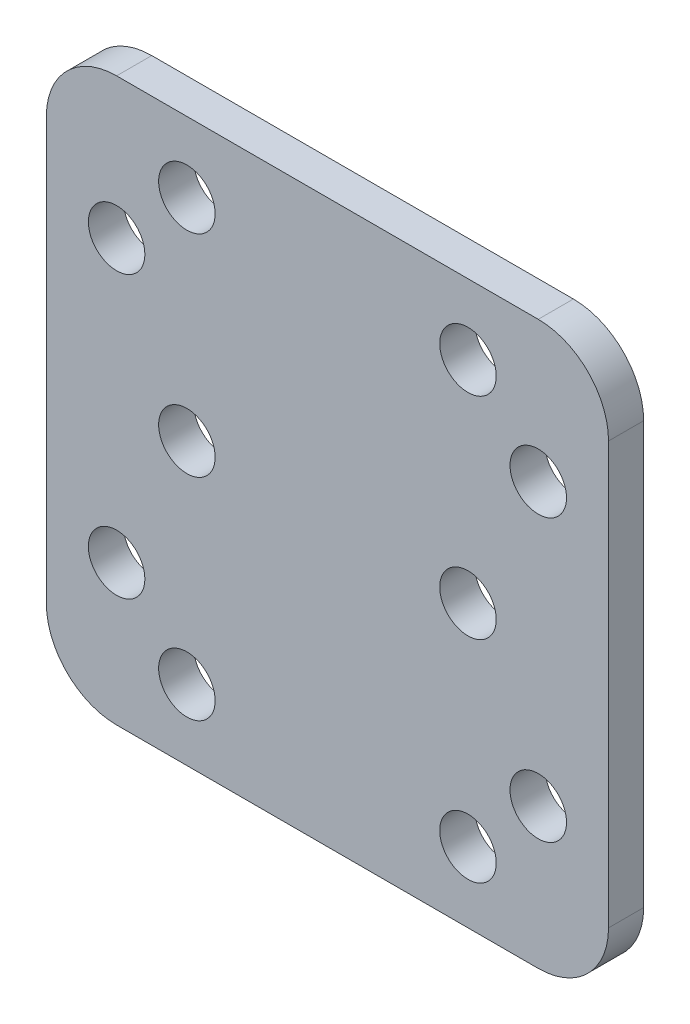
ISO-10303-21;
HEADER;
FILE_DESCRIPTION(('STEP AP214'),'2;1');
FILE_NAME('part.step','',(''),(''),'','','');
FILE_SCHEMA(('AUTOMOTIVE_DESIGN { 1 0 10303 214 1 1 1 1 }'));
ENDSEC;
DATA;
#1=APPLICATION_CONTEXT('core data for automotive mechanical design processes');
#2=APPLICATION_PROTOCOL_DEFINITION('international standard','automotive_design',2000,#1);
#3=PRODUCT_CONTEXT('',#1,'mechanical');
#4=PRODUCT('Part','Part','',(#3));
#5=PRODUCT_RELATED_PRODUCT_CATEGORY('part','',(#4));
#6=PRODUCT_DEFINITION_FORMATION('','',#4);
#7=PRODUCT_DEFINITION_CONTEXT('part definition',#1,'design');
#8=PRODUCT_DEFINITION('design','',#6,#7);
#9=PRODUCT_DEFINITION_SHAPE('','',#8);
#10=(LENGTH_UNIT() NAMED_UNIT(*) SI_UNIT(.MILLI.,.METRE.));
#11=(NAMED_UNIT(*) PLANE_ANGLE_UNIT() SI_UNIT($,.RADIAN.));
#12=(NAMED_UNIT(*) SI_UNIT($,.STERADIAN.) SOLID_ANGLE_UNIT());
#13=UNCERTAINTY_MEASURE_WITH_UNIT(LENGTH_MEASURE(1.E-05),#10,'distance_accuracy_value','');
#14=(GEOMETRIC_REPRESENTATION_CONTEXT(3) GLOBAL_UNCERTAINTY_ASSIGNED_CONTEXT((#13)) GLOBAL_UNIT_ASSIGNED_CONTEXT((#10,
#11,#12)) REPRESENTATION_CONTEXT('',''));
#15=CARTESIAN_POINT('',(0.,0.,0.));
#16=DIRECTION('',(0.,0.,1.));
#17=DIRECTION('',(1.,0.,0.));
#18=AXIS2_PLACEMENT_3D('',#15,#16,#17);
#19=CARTESIAN_POINT('',(6.34999999985809,2.37276864822889E-11,0.));
#20=DIRECTION('',(0.,0.,1.));
#21=DIRECTION('',(1.,0.,0.));
#22=AXIS2_PLACEMENT_3D('',#19,#20,#21);
#23=PLANE('',#22);
#24=CARTESIAN_POINT('',(-12.7000000001419,12.7000000000238,0.));
#25=DIRECTION('',(0.,0.,-1.));
#26=DIRECTION('',(-1.,0.,0.));
#27=AXIS2_PLACEMENT_3D('',#24,#25,#26);
#28=CIRCLE('',#27,2.5527);
#29=CARTESIAN_POINT('',(-10.1473000001419,12.7000000000238,0.));
#30=VERTEX_POINT('',#29);
#31=EDGE_CURVE('E186',#30,#30,#28,.T.);
#32=ORIENTED_EDGE('',*,*,#31,.F.);
#33=EDGE_LOOP('',(#32));
#34=FACE_BOUND('',#33,.T.);
#35=CARTESIAN_POINT('',(-6.35000000014201,19.0500000000238,0.));
#36=DIRECTION('',(0.,0.,-1.));
#37=DIRECTION('',(-1.,0.,0.));
#38=AXIS2_PLACEMENT_3D('',#35,#36,#37);
#39=CIRCLE('',#38,2.5527);
#40=CARTESIAN_POINT('',(-3.79730000014201,19.0500000000238,0.));
#41=VERTEX_POINT('',#40);
#42=EDGE_CURVE('E206',#41,#41,#39,.T.);
#43=ORIENTED_EDGE('',*,*,#42,.F.);
#44=EDGE_LOOP('',(#43));
#45=FACE_BOUND('',#44,.T.);
#46=CARTESIAN_POINT('',(19.0499999998582,19.0500000000238,0.));
#47=DIRECTION('',(0.,0.,-1.));
#48=DIRECTION('',(-1.,0.,0.));
#49=AXIS2_PLACEMENT_3D('',#46,#47,#48);
#50=CIRCLE('',#49,2.5527);
#51=CARTESIAN_POINT('',(21.6026999998582,19.0500000000238,0.));
#52=VERTEX_POINT('',#51);
#53=EDGE_CURVE('E224',#52,#52,#50,.T.);
#54=ORIENTED_EDGE('',*,*,#53,.F.);
#55=EDGE_LOOP('',(#54));
#56=FACE_BOUND('',#55,.T.);
#57=CARTESIAN_POINT('',(19.0499999998582,2.35908870584317E-11,0.));
#58=DIRECTION('',(0.,0.,-1.));
#59=DIRECTION('',(-1.,0.,0.));
#60=AXIS2_PLACEMENT_3D('',#57,#58,#59);
#61=CIRCLE('',#60,2.5527);
#62=CARTESIAN_POINT('',(21.6026999998582,2.35901822884954E-11,0.));
#63=VERTEX_POINT('',#62);
#64=EDGE_CURVE('E205',#63,#63,#61,.T.);
#65=ORIENTED_EDGE('',*,*,#64,.F.);
#66=EDGE_LOOP('',(#65));
#67=FACE_BOUND('',#66,.T.);
#68=CARTESIAN_POINT('',(25.3999999998581,12.7000000000238,0.));
#69=DIRECTION('',(0.,0.,-1.));
#70=DIRECTION('',(-1.,0.,0.));
#71=AXIS2_PLACEMENT_3D('',#68,#69,#70);
#72=CIRCLE('',#71,2.5527);
#73=CARTESIAN_POINT('',(27.952699999858,12.7000000000238,0.));
#74=VERTEX_POINT('',#73);
#75=EDGE_CURVE('E281',#74,#74,#72,.T.);
#76=ORIENTED_EDGE('',*,*,#75,.F.);
#77=EDGE_LOOP('',(#76));
#78=FACE_BOUND('',#77,.T.);
#79=CARTESIAN_POINT('',(25.3999999998581,-12.6999999999764,0.));
#80=DIRECTION('',(0.,0.,-1.));
#81=DIRECTION('',(-1.,0.,0.));
#82=AXIS2_PLACEMENT_3D('',#79,#80,#81);
#83=CIRCLE('',#82,2.5527);
#84=CARTESIAN_POINT('',(27.952699999858,-12.6999999999764,0.));
#85=VERTEX_POINT('',#84);
#86=EDGE_CURVE('E259',#85,#85,#83,.T.);
#87=ORIENTED_EDGE('',*,*,#86,.F.);
#88=EDGE_LOOP('',(#87));
#89=FACE_BOUND('',#88,.T.);
#90=CARTESIAN_POINT('',(19.0499999998582,-19.0499999999764,0.));
#91=DIRECTION('',(0.,0.,-1.));
#92=DIRECTION('',(-1.,0.,0.));
#93=AXIS2_PLACEMENT_3D('',#90,#91,#92);
#94=CIRCLE('',#93,2.5527);
#95=CARTESIAN_POINT('',(21.6026999998582,-19.0499999999764,0.));
#96=VERTEX_POINT('',#95);
#97=EDGE_CURVE('E299',#96,#96,#94,.T.);
#98=ORIENTED_EDGE('',*,*,#97,.F.);
#99=EDGE_LOOP('',(#98));
#100=FACE_BOUND('',#99,.T.);
#101=CARTESIAN_POINT('',(-6.35000000014201,-19.0499999999764,0.));
#102=DIRECTION('',(0.,0.,-1.));
#103=DIRECTION('',(-1.,0.,0.));
#104=AXIS2_PLACEMENT_3D('',#101,#102,#103);
#105=CIRCLE('',#104,2.5527);
#106=CARTESIAN_POINT('',(-3.79730000014201,-19.0499999999764,0.));
#107=VERTEX_POINT('',#106);
#108=EDGE_CURVE('E310',#107,#107,#105,.T.);
#109=ORIENTED_EDGE('',*,*,#108,.F.);
#110=EDGE_LOOP('',(#109));
#111=FACE_BOUND('',#110,.T.);
#112=CARTESIAN_POINT('',(-12.7000000001419,-12.6999999999764,0.));
#113=DIRECTION('',(0.,0.,-1.));
#114=DIRECTION('',(-1.,0.,0.));
#115=AXIS2_PLACEMENT_3D('',#112,#113,#114);
#116=CIRCLE('',#115,2.5527);
#117=CARTESIAN_POINT('',(-10.1473000001419,-12.6999999999764,0.));
#118=VERTEX_POINT('',#117);
#119=EDGE_CURVE('E321',#118,#118,#116,.T.);
#120=ORIENTED_EDGE('',*,*,#119,.F.);
#121=EDGE_LOOP('',(#120));
#122=FACE_BOUND('',#121,.T.);
#123=CARTESIAN_POINT('',(-6.35000000014201,2.35832467290903E-11,0.));
#124=DIRECTION('',(0.,0.,-1.));
#125=DIRECTION('',(-1.,0.,0.));
#126=AXIS2_PLACEMENT_3D('',#123,#124,#125);
#127=CIRCLE('',#126,2.5527);
#128=CARTESIAN_POINT('',(-3.79730000014201,2.35825419591539E-11,0.));
#129=VERTEX_POINT('',#128);
#130=EDGE_CURVE('E241',#129,#129,#127,.T.);
#131=ORIENTED_EDGE('',*,*,#130,.F.);
#132=EDGE_LOOP('',(#131));
#133=FACE_BOUND('',#132,.T.);
#134=DIRECTION('',(1.,0.,0.));
#135=VECTOR('',#134,1.);
#136=CARTESIAN_POINT('',(-12.700000000142,-25.3999999999765,0.));
#137=LINE('',#136,#135);
#138=CARTESIAN_POINT('',(-12.700000000142,-25.3999999999765,0.));
#139=VERTEX_POINT('',#138);
#140=CARTESIAN_POINT('',(25.3999999998581,-25.3999999999764,0.));
#141=VERTEX_POINT('',#140);
#142=EDGE_CURVE('E25',#139,#141,#137,.T.);
#143=ORIENTED_EDGE('',*,*,#142,.F.);
#144=CARTESIAN_POINT('',(-12.7000000001419,-19.0499999999764,0.));
#145=DIRECTION('',(0.,0.,1.));
#146=DIRECTION('',(-1.,0.,0.));
#147=AXIS2_PLACEMENT_3D('',#144,#145,#146);
#148=CIRCLE('',#147,6.35);
#149=CARTESIAN_POINT('',(-19.0500000001419,-19.0499999999763,0.));
#150=VERTEX_POINT('',#149);
#151=EDGE_CURVE('E237',#150,#139,#148,.T.);
#152=ORIENTED_EDGE('',*,*,#151,.F.);
#153=DIRECTION('',(0.,-1.,0.));
#154=VECTOR('',#153,1.);
#155=CARTESIAN_POINT('',(-19.0500000001419,19.0500000000237,0.));
#156=LINE('',#155,#154);
#157=CARTESIAN_POINT('',(-19.0500000001419,19.0500000000237,0.));
#158=VERTEX_POINT('',#157);
#159=EDGE_CURVE('E258',#158,#150,#156,.T.);
#160=ORIENTED_EDGE('',*,*,#159,.F.);
#161=CARTESIAN_POINT('',(-12.7000000001419,19.0500000000238,0.));
#162=DIRECTION('',(0.,0.,1.));
#163=DIRECTION('',(0.,1.,0.));
#164=AXIS2_PLACEMENT_3D('',#161,#162,#163);
#165=CIRCLE('',#164,6.35);
#166=CARTESIAN_POINT('',(-12.700000000142,25.4000000000238,0.));
#167=VERTEX_POINT('',#166);
#168=EDGE_CURVE('E275',#167,#158,#165,.T.);
#169=ORIENTED_EDGE('',*,*,#168,.F.);
#170=DIRECTION('',(-1.,0.,0.));
#171=VECTOR('',#170,1.);
#172=CARTESIAN_POINT('',(25.3999999998582,25.4000000000238,0.));
#173=LINE('',#172,#171);
#174=CARTESIAN_POINT('',(25.3999999998582,25.4000000000238,0.));
#175=VERTEX_POINT('',#174);
#176=EDGE_CURVE('E267',#175,#167,#173,.T.);
#177=ORIENTED_EDGE('',*,*,#176,.F.);
#178=CARTESIAN_POINT('',(25.3999999998581,19.0500000000238,0.));
#179=DIRECTION('',(0.,0.,1.));
#180=DIRECTION('',(1.,0.,0.));
#181=AXIS2_PLACEMENT_3D('',#178,#179,#180);
#182=CIRCLE('',#181,6.35);
#183=CARTESIAN_POINT('',(31.749999999858,19.0500000000238,0.));
#184=VERTEX_POINT('',#183);
#185=EDGE_CURVE('E214',#184,#175,#182,.T.);
#186=ORIENTED_EDGE('',*,*,#185,.F.);
#187=DIRECTION('',(0.,1.,0.));
#188=VECTOR('',#187,1.);
#189=CARTESIAN_POINT('',(31.749999999858,-19.0499999999764,0.));
#190=LINE('',#189,#188);
#191=CARTESIAN_POINT('',(31.749999999858,-19.0499999999764,0.));
#192=VERTEX_POINT('',#191);
#193=EDGE_CURVE('E361',#192,#184,#190,.T.);
#194=ORIENTED_EDGE('',*,*,#193,.F.);
#195=CARTESIAN_POINT('',(25.3999999998581,-19.0499999999764,0.));
#196=DIRECTION('',(0.,0.,1.));
#197=DIRECTION('',(0.,-1.,0.));
#198=AXIS2_PLACEMENT_3D('',#195,#196,#197);
#199=CIRCLE('',#198,6.35);
#200=EDGE_CURVE('E305',#141,#192,#199,.T.);
#201=ORIENTED_EDGE('',*,*,#200,.F.);
#202=EDGE_LOOP('',(#143,#152,#160,#169,#177,#186,#194,#201));
#203=FACE_BOUND('',#202,.T.);
#204=ADVANCED_FACE('F17',(#34,#45,#56,#67,#78,#89,#100,#111,#122,#133,#203),#23,.F.);
#205=CARTESIAN_POINT('',(6.34999999985809,2.37276864822889E-11,3.175));
#206=DIRECTION('',(0.,0.,1.));
#207=DIRECTION('',(1.,0.,0.));
#208=AXIS2_PLACEMENT_3D('',#205,#206,#207);
#209=PLANE('',#208);
#210=CARTESIAN_POINT('',(-12.7000000001419,12.7000000000238,3.175));
#211=DIRECTION('',(0.,0.,-1.));
#212=DIRECTION('',(-1.,0.,0.));
#213=AXIS2_PLACEMENT_3D('',#210,#211,#212);
#214=CIRCLE('',#213,2.5527);
#215=CARTESIAN_POINT('',(-10.1473000001419,12.7000000000238,3.175));
#216=VERTEX_POINT('',#215);
#217=EDGE_CURVE('E184',#216,#216,#214,.T.);
#218=ORIENTED_EDGE('',*,*,#217,.T.);
#219=EDGE_LOOP('',(#218));
#220=FACE_BOUND('',#219,.T.);
#221=CARTESIAN_POINT('',(-6.35000000014201,19.0500000000238,3.175));
#222=DIRECTION('',(0.,0.,-1.));
#223=DIRECTION('',(-1.,0.,0.));
#224=AXIS2_PLACEMENT_3D('',#221,#222,#223);
#225=CIRCLE('',#224,2.5527);
#226=CARTESIAN_POINT('',(-3.79730000014201,19.0500000000238,3.175));
#227=VERTEX_POINT('',#226);
#228=EDGE_CURVE('E213',#227,#227,#225,.T.);
#229=ORIENTED_EDGE('',*,*,#228,.T.);
#230=EDGE_LOOP('',(#229));
#231=FACE_BOUND('',#230,.T.);
#232=CARTESIAN_POINT('',(19.0499999998582,19.0500000000238,3.175));
#233=DIRECTION('',(0.,0.,-1.));
#234=DIRECTION('',(-1.,0.,0.));
#235=AXIS2_PLACEMENT_3D('',#232,#233,#234);
#236=CIRCLE('',#235,2.5527);
#237=CARTESIAN_POINT('',(21.6026999998582,19.0500000000238,3.175));
#238=VERTEX_POINT('',#237);
#239=EDGE_CURVE('E209',#238,#238,#236,.T.);
#240=ORIENTED_EDGE('',*,*,#239,.T.);
#241=EDGE_LOOP('',(#240));
#242=FACE_BOUND('',#241,.T.);
#243=CARTESIAN_POINT('',(19.0499999998582,2.35908870584317E-11,3.175));
#244=DIRECTION('',(0.,0.,-1.));
#245=DIRECTION('',(-1.,0.,0.));
#246=AXIS2_PLACEMENT_3D('',#243,#244,#245);
#247=CIRCLE('',#246,2.5527);
#248=CARTESIAN_POINT('',(21.6026999998582,2.35900188272353E-11,3.175));
#249=VERTEX_POINT('',#248);
#250=EDGE_CURVE('E219',#249,#249,#247,.T.);
#251=ORIENTED_EDGE('',*,*,#250,.T.);
#252=EDGE_LOOP('',(#251));
#253=FACE_BOUND('',#252,.T.);
#254=CARTESIAN_POINT('',(25.3999999998581,12.7000000000238,3.175));
#255=DIRECTION('',(0.,0.,-1.));
#256=DIRECTION('',(-1.,0.,0.));
#257=AXIS2_PLACEMENT_3D('',#254,#255,#256);
#258=CIRCLE('',#257,2.5527);
#259=CARTESIAN_POINT('',(27.952699999858,12.7000000000238,3.175));
#260=VERTEX_POINT('',#259);
#261=EDGE_CURVE('E200',#260,#260,#258,.T.);
#262=ORIENTED_EDGE('',*,*,#261,.T.);
#263=EDGE_LOOP('',(#262));
#264=FACE_BOUND('',#263,.T.);
#265=CARTESIAN_POINT('',(25.3999999998581,-12.6999999999764,3.175));
#266=DIRECTION('',(0.,0.,-1.));
#267=DIRECTION('',(-1.,0.,0.));
#268=AXIS2_PLACEMENT_3D('',#265,#266,#267);
#269=CIRCLE('',#268,2.5527);
#270=CARTESIAN_POINT('',(27.952699999858,-12.6999999999764,3.175));
#271=VERTEX_POINT('',#270);
#272=EDGE_CURVE('E197',#271,#271,#269,.T.);
#273=ORIENTED_EDGE('',*,*,#272,.T.);
#274=EDGE_LOOP('',(#273));
#275=FACE_BOUND('',#274,.T.);
#276=CARTESIAN_POINT('',(19.0499999998582,-19.0499999999764,3.175));
#277=DIRECTION('',(0.,0.,-1.));
#278=DIRECTION('',(-1.,0.,0.));
#279=AXIS2_PLACEMENT_3D('',#276,#277,#278);
#280=CIRCLE('',#279,2.5527);
#281=CARTESIAN_POINT('',(21.6026999998582,-19.0499999999764,3.175));
#282=VERTEX_POINT('',#281);
#283=EDGE_CURVE('E262',#282,#282,#280,.T.);
#284=ORIENTED_EDGE('',*,*,#283,.T.);
#285=EDGE_LOOP('',(#284));
#286=FACE_BOUND('',#285,.T.);
#287=CARTESIAN_POINT('',(-6.35000000014201,-19.0499999999764,3.175));
#288=DIRECTION('',(0.,0.,-1.));
#289=DIRECTION('',(-1.,0.,0.));
#290=AXIS2_PLACEMENT_3D('',#287,#288,#289);
#291=CIRCLE('',#290,2.5527);
#292=CARTESIAN_POINT('',(-3.79730000014201,-19.0499999999764,3.175));
#293=VERTEX_POINT('',#292);
#294=EDGE_CURVE('E302',#293,#293,#291,.T.);
#295=ORIENTED_EDGE('',*,*,#294,.T.);
#296=EDGE_LOOP('',(#295));
#297=FACE_BOUND('',#296,.T.);
#298=CARTESIAN_POINT('',(-12.7000000001419,-12.6999999999764,3.175));
#299=DIRECTION('',(0.,0.,-1.));
#300=DIRECTION('',(-1.,0.,0.));
#301=AXIS2_PLACEMENT_3D('',#298,#299,#300);
#302=CIRCLE('',#301,2.5527);
#303=CARTESIAN_POINT('',(-10.1473000001419,-12.6999999999764,3.175));
#304=VERTEX_POINT('',#303);
#305=EDGE_CURVE('E313',#304,#304,#302,.T.);
#306=ORIENTED_EDGE('',*,*,#305,.T.);
#307=EDGE_LOOP('',(#306));
#308=FACE_BOUND('',#307,.T.);
#309=CARTESIAN_POINT('',(-6.35000000014201,2.35832467290903E-11,3.175));
#310=DIRECTION('',(0.,0.,-1.));
#311=DIRECTION('',(-1.,0.,0.));
#312=AXIS2_PLACEMENT_3D('',#309,#310,#311);
#313=CIRCLE('',#312,2.5527);
#314=CARTESIAN_POINT('',(-3.79730000014201,2.35811370430383E-11,3.175));
#315=VERTEX_POINT('',#314);
#316=EDGE_CURVE('E295',#315,#315,#313,.T.);
#317=ORIENTED_EDGE('',*,*,#316,.T.);
#318=EDGE_LOOP('',(#317));
#319=FACE_BOUND('',#318,.T.);
#320=DIRECTION('',(1.,0.,0.));
#321=VECTOR('',#320,1.);
#322=CARTESIAN_POINT('',(-12.700000000142,-25.3999999999765,3.175));
#323=LINE('',#322,#321);
#324=CARTESIAN_POINT('',(-12.700000000142,-25.3999999999765,3.175));
#325=VERTEX_POINT('',#324);
#326=CARTESIAN_POINT('',(25.3999999998581,-25.3999999999764,3.175));
#327=VERTEX_POINT('',#326);
#328=EDGE_CURVE('E11',#325,#327,#323,.T.);
#329=ORIENTED_EDGE('',*,*,#328,.T.);
#330=CARTESIAN_POINT('',(25.3999999998581,-19.0499999999764,3.175));
#331=DIRECTION('',(0.,0.,1.));
#332=DIRECTION('',(0.,-1.,0.));
#333=AXIS2_PLACEMENT_3D('',#330,#331,#332);
#334=CIRCLE('',#333,6.35);
#335=CARTESIAN_POINT('',(31.749999999858,-19.0499999999764,3.175));
#336=VERTEX_POINT('',#335);
#337=EDGE_CURVE('E231',#327,#336,#334,.T.);
#338=ORIENTED_EDGE('',*,*,#337,.T.);
#339=DIRECTION('',(0.,1.,0.));
#340=VECTOR('',#339,1.);
#341=CARTESIAN_POINT('',(31.749999999858,-19.0499999999764,3.175));
#342=LINE('',#341,#340);
#343=CARTESIAN_POINT('',(31.749999999858,19.0500000000238,3.175));
#344=VERTEX_POINT('',#343);
#345=EDGE_CURVE('E328',#336,#344,#342,.T.);
#346=ORIENTED_EDGE('',*,*,#345,.T.);
#347=CARTESIAN_POINT('',(25.3999999998581,19.0500000000238,3.175));
#348=DIRECTION('',(0.,0.,1.));
#349=DIRECTION('',(1.,0.,0.));
#350=AXIS2_PLACEMENT_3D('',#347,#348,#349);
#351=CIRCLE('',#350,6.35);
#352=CARTESIAN_POINT('',(25.3999999998582,25.4000000000238,3.175));
#353=VERTEX_POINT('',#352);
#354=EDGE_CURVE('E217',#344,#353,#351,.T.);
#355=ORIENTED_EDGE('',*,*,#354,.T.);
#356=DIRECTION('',(-1.,0.,0.));
#357=VECTOR('',#356,1.);
#358=CARTESIAN_POINT('',(25.3999999998582,25.4000000000238,3.175));
#359=LINE('',#358,#357);
#360=CARTESIAN_POINT('',(-12.700000000142,25.4000000000238,3.175));
#361=VERTEX_POINT('',#360);
#362=EDGE_CURVE('E270',#353,#361,#359,.T.);
#363=ORIENTED_EDGE('',*,*,#362,.T.);
#364=CARTESIAN_POINT('',(-12.7000000001419,19.0500000000238,3.175));
#365=DIRECTION('',(0.,0.,1.));
#366=DIRECTION('',(0.,1.,0.));
#367=AXIS2_PLACEMENT_3D('',#364,#365,#366);
#368=CIRCLE('',#367,6.35);
#369=CARTESIAN_POINT('',(-19.0500000001419,19.0500000000237,3.175));
#370=VERTEX_POINT('',#369);
#371=EDGE_CURVE('E272',#361,#370,#368,.T.);
#372=ORIENTED_EDGE('',*,*,#371,.T.);
#373=DIRECTION('',(0.,-1.,0.));
#374=VECTOR('',#373,1.);
#375=CARTESIAN_POINT('',(-19.0500000001419,19.0500000000237,3.175));
#376=LINE('',#375,#374);
#377=CARTESIAN_POINT('',(-19.0500000001419,-19.0499999999763,3.175));
#378=VERTEX_POINT('',#377);
#379=EDGE_CURVE('E338',#370,#378,#376,.T.);
#380=ORIENTED_EDGE('',*,*,#379,.T.);
#381=CARTESIAN_POINT('',(-12.7000000001419,-19.0499999999764,3.175));
#382=DIRECTION('',(0.,0.,1.));
#383=DIRECTION('',(-1.,0.,0.));
#384=AXIS2_PLACEMENT_3D('',#381,#382,#383);
#385=CIRCLE('',#384,6.35);
#386=EDGE_CURVE('E236',#378,#325,#385,.T.);
#387=ORIENTED_EDGE('',*,*,#386,.T.);
#388=EDGE_LOOP('',(#329,#338,#346,#355,#363,#372,#380,#387));
#389=FACE_BOUND('',#388,.T.);
#390=ADVANCED_FACE('F190',(#220,#231,#242,#253,#264,#275,#286,#297,#308,#319,#389),#209,.T.);
#391=CARTESIAN_POINT('',(-12.700000000142,-25.3999999999765,0.));
#392=DIRECTION('',(0.,-1.,0.));
#393=DIRECTION('',(0.,0.,-1.));
#394=AXIS2_PLACEMENT_3D('',#391,#392,#393);
#395=PLANE('',#394);
#396=ORIENTED_EDGE('',*,*,#142,.T.);
#397=DIRECTION('',(0.,0.,1.));
#398=VECTOR('',#397,1.);
#399=CARTESIAN_POINT('',(25.3999999998581,-25.3999999999764,0.));
#400=LINE('',#399,#398);
#401=EDGE_CURVE('E228',#141,#327,#400,.T.);
#402=ORIENTED_EDGE('',*,*,#401,.T.);
#403=ORIENTED_EDGE('',*,*,#328,.F.);
#404=DIRECTION('',(0.,0.,1.));
#405=VECTOR('',#404,1.);
#406=CARTESIAN_POINT('',(-12.700000000142,-25.3999999999765,0.));
#407=LINE('',#406,#405);
#408=EDGE_CURVE('E232',#139,#325,#407,.T.);
#409=ORIENTED_EDGE('',*,*,#408,.F.);
#410=EDGE_LOOP('',(#396,#402,#403,#409));
#411=FACE_BOUND('',#410,.T.);
#412=ADVANCED_FACE('F506',(#411),#395,.T.);
#413=CARTESIAN_POINT('',(25.3999999998581,-19.0499999999764,0.));
#414=DIRECTION('',(0.,0.,1.));
#415=DIRECTION('',(0.,-1.,0.));
#416=AXIS2_PLACEMENT_3D('',#413,#414,#415);
#417=CYLINDRICAL_SURFACE('',#416,6.35);
#418=ORIENTED_EDGE('',*,*,#200,.T.);
#419=DIRECTION('',(0.,0.,1.));
#420=VECTOR('',#419,1.);
#421=CARTESIAN_POINT('',(31.749999999858,-19.0499999999764,0.));
#422=LINE('',#421,#420);
#423=EDGE_CURVE('E324',#192,#336,#422,.T.);
#424=ORIENTED_EDGE('',*,*,#423,.T.);
#425=ORIENTED_EDGE('',*,*,#337,.F.);
#426=ORIENTED_EDGE('',*,*,#401,.F.);
#427=EDGE_LOOP('',(#418,#424,#425,#426));
#428=FACE_BOUND('',#427,.T.);
#429=ADVANCED_FACE('F498',(#428),#417,.T.);
#430=CARTESIAN_POINT('',(31.749999999858,-19.0499999999764,0.));
#431=DIRECTION('',(1.,0.,0.));
#432=DIRECTION('',(0.,-1.,0.));
#433=AXIS2_PLACEMENT_3D('',#430,#431,#432);
#434=PLANE('',#433);
#435=ORIENTED_EDGE('',*,*,#193,.T.);
#436=DIRECTION('',(0.,0.,1.));
#437=VECTOR('',#436,1.);
#438=CARTESIAN_POINT('',(31.749999999858,19.0500000000238,0.));
#439=LINE('',#438,#437);
#440=EDGE_CURVE('E357',#184,#344,#439,.T.);
#441=ORIENTED_EDGE('',*,*,#440,.T.);
#442=ORIENTED_EDGE('',*,*,#345,.F.);
#443=ORIENTED_EDGE('',*,*,#423,.F.);
#444=EDGE_LOOP('',(#435,#441,#442,#443));
#445=FACE_BOUND('',#444,.T.);
#446=ADVANCED_FACE('F490',(#445),#434,.T.);
#447=CARTESIAN_POINT('',(25.3999999998581,19.0500000000238,0.));
#448=DIRECTION('',(0.,0.,1.));
#449=DIRECTION('',(1.,0.,0.));
#450=AXIS2_PLACEMENT_3D('',#447,#448,#449);
#451=CYLINDRICAL_SURFACE('',#450,6.35);
#452=ORIENTED_EDGE('',*,*,#185,.T.);
#453=DIRECTION('',(0.,0.,1.));
#454=VECTOR('',#453,1.);
#455=CARTESIAN_POINT('',(25.3999999998582,25.4000000000238,0.));
#456=LINE('',#455,#454);
#457=EDGE_CURVE('E218',#175,#353,#456,.T.);
#458=ORIENTED_EDGE('',*,*,#457,.T.);
#459=ORIENTED_EDGE('',*,*,#354,.F.);
#460=ORIENTED_EDGE('',*,*,#440,.F.);
#461=EDGE_LOOP('',(#452,#458,#459,#460));
#462=FACE_BOUND('',#461,.T.);
#463=ADVANCED_FACE('F438',(#462),#451,.T.);
#464=CARTESIAN_POINT('',(25.3999999998582,25.4000000000238,0.));
#465=DIRECTION('',(0.,1.,0.));
#466=DIRECTION('',(1.,0.,0.));
#467=AXIS2_PLACEMENT_3D('',#464,#465,#466);
#468=PLANE('',#467);
#469=ORIENTED_EDGE('',*,*,#176,.T.);
#470=DIRECTION('',(0.,0.,1.));
#471=VECTOR('',#470,1.);
#472=CARTESIAN_POINT('',(-12.700000000142,25.4000000000238,0.));
#473=LINE('',#472,#471);
#474=EDGE_CURVE('E271',#167,#361,#473,.T.);
#475=ORIENTED_EDGE('',*,*,#474,.T.);
#476=ORIENTED_EDGE('',*,*,#362,.F.);
#477=ORIENTED_EDGE('',*,*,#457,.F.);
#478=EDGE_LOOP('',(#469,#475,#476,#477));
#479=FACE_BOUND('',#478,.T.);
#480=ADVANCED_FACE('F433',(#479),#468,.T.);
#481=CARTESIAN_POINT('',(-12.7000000001419,19.0500000000238,0.));
#482=DIRECTION('',(0.,0.,1.));
#483=DIRECTION('',(0.,1.,0.));
#484=AXIS2_PLACEMENT_3D('',#481,#482,#483);
#485=CYLINDRICAL_SURFACE('',#484,6.35);
#486=ORIENTED_EDGE('',*,*,#168,.T.);
#487=DIRECTION('',(0.,0.,1.));
#488=VECTOR('',#487,1.);
#489=CARTESIAN_POINT('',(-19.0500000001419,19.0500000000237,0.));
#490=LINE('',#489,#488);
#491=EDGE_CURVE('E341',#158,#370,#490,.T.);
#492=ORIENTED_EDGE('',*,*,#491,.T.);
#493=ORIENTED_EDGE('',*,*,#371,.F.);
#494=ORIENTED_EDGE('',*,*,#474,.F.);
#495=EDGE_LOOP('',(#486,#492,#493,#494));
#496=FACE_BOUND('',#495,.T.);
#497=ADVANCED_FACE('F437',(#496),#485,.T.);
#498=CARTESIAN_POINT('',(-19.0500000001419,19.0500000000237,0.));
#499=DIRECTION('',(-1.,0.,0.));
#500=DIRECTION('',(0.,1.,0.));
#501=AXIS2_PLACEMENT_3D('',#498,#499,#500);
#502=PLANE('',#501);
#503=ORIENTED_EDGE('',*,*,#159,.T.);
#504=DIRECTION('',(0.,0.,1.));
#505=VECTOR('',#504,1.);
#506=CARTESIAN_POINT('',(-19.0500000001419,-19.0499999999763,0.));
#507=LINE('',#506,#505);
#508=EDGE_CURVE('E254',#150,#378,#507,.T.);
#509=ORIENTED_EDGE('',*,*,#508,.T.);
#510=ORIENTED_EDGE('',*,*,#379,.F.);
#511=ORIENTED_EDGE('',*,*,#491,.F.);
#512=EDGE_LOOP('',(#503,#509,#510,#511));
#513=FACE_BOUND('',#512,.T.);
#514=ADVANCED_FACE('F468',(#513),#502,.T.);
#515=CARTESIAN_POINT('',(-12.7000000001419,-19.0499999999764,0.));
#516=DIRECTION('',(0.,0.,1.));
#517=DIRECTION('',(-1.,0.,0.));
#518=AXIS2_PLACEMENT_3D('',#515,#516,#517);
#519=CYLINDRICAL_SURFACE('',#518,6.35);
#520=ORIENTED_EDGE('',*,*,#151,.T.);
#521=ORIENTED_EDGE('',*,*,#408,.T.);
#522=ORIENTED_EDGE('',*,*,#386,.F.);
#523=ORIENTED_EDGE('',*,*,#508,.F.);
#524=EDGE_LOOP('',(#520,#521,#522,#523));
#525=FACE_BOUND('',#524,.T.);
#526=ADVANCED_FACE('F460',(#525),#519,.T.);
#527=CARTESIAN_POINT('',(-6.35000000014201,2.35832467290903E-11,0.));
#528=DIRECTION('',(0.,0.,1.));
#529=DIRECTION('',(-1.,0.,0.));
#530=AXIS2_PLACEMENT_3D('',#527,#528,#529);
#531=CYLINDRICAL_SURFACE('',#530,2.5527);
#532=ORIENTED_EDGE('',*,*,#316,.F.);
#533=DIRECTION('',(0.,0.,-1.));
#534=VECTOR('',#533,1.);
#535=CARTESIAN_POINT('',(-3.79730000014201,2.35825419591539E-11,0.));
#536=LINE('',#535,#534);
#537=EDGE_CURVE('E291',#315,#129,#536,.T.);
#538=ORIENTED_EDGE('',*,*,#537,.T.);
#539=ORIENTED_EDGE('',*,*,#130,.T.);
#540=ORIENTED_EDGE('',*,*,#537,.F.);
#541=EDGE_LOOP('',(#532,#538,#539,#540));
#542=FACE_BOUND('',#541,.T.);
#543=ADVANCED_FACE('F413',(#542),#531,.F.);
#544=CARTESIAN_POINT('',(-12.7000000001419,-12.6999999999764,0.));
#545=DIRECTION('',(0.,0.,1.));
#546=DIRECTION('',(-1.,0.,0.));
#547=AXIS2_PLACEMENT_3D('',#544,#545,#546);
#548=CYLINDRICAL_SURFACE('',#547,2.5527);
#549=ORIENTED_EDGE('',*,*,#305,.F.);
#550=DIRECTION('',(0.,0.,-1.));
#551=VECTOR('',#550,1.);
#552=CARTESIAN_POINT('',(-10.1473000001419,-12.6999999999764,0.));
#553=LINE('',#552,#551);
#554=EDGE_CURVE('E317',#304,#118,#553,.T.);
#555=ORIENTED_EDGE('',*,*,#554,.T.);
#556=ORIENTED_EDGE('',*,*,#119,.T.);
#557=ORIENTED_EDGE('',*,*,#554,.F.);
#558=EDGE_LOOP('',(#549,#555,#556,#557));
#559=FACE_BOUND('',#558,.T.);
#560=ADVANCED_FACE('F409',(#559),#548,.F.);
#561=CARTESIAN_POINT('',(-6.35000000014201,-19.0499999999764,0.));
#562=DIRECTION('',(0.,0.,1.));
#563=DIRECTION('',(-1.,0.,0.));
#564=AXIS2_PLACEMENT_3D('',#561,#562,#563);
#565=CYLINDRICAL_SURFACE('',#564,2.5527);
#566=ORIENTED_EDGE('',*,*,#294,.F.);
#567=DIRECTION('',(0.,0.,-1.));
#568=VECTOR('',#567,1.);
#569=CARTESIAN_POINT('',(-3.79730000014201,-19.0499999999764,0.));
#570=LINE('',#569,#568);
#571=EDGE_CURVE('E306',#293,#107,#570,.T.);
#572=ORIENTED_EDGE('',*,*,#571,.T.);
#573=ORIENTED_EDGE('',*,*,#108,.T.);
#574=ORIENTED_EDGE('',*,*,#571,.F.);
#575=EDGE_LOOP('',(#566,#572,#573,#574));
#576=FACE_BOUND('',#575,.T.);
#577=ADVANCED_FACE('F380',(#576),#565,.F.);
#578=CARTESIAN_POINT('',(19.0499999998582,-19.0499999999764,0.));
#579=DIRECTION('',(0.,0.,1.));
#580=DIRECTION('',(-1.,0.,0.));
#581=AXIS2_PLACEMENT_3D('',#578,#579,#580);
#582=CYLINDRICAL_SURFACE('',#581,2.5527);
#583=ORIENTED_EDGE('',*,*,#283,.F.);
#584=DIRECTION('',(0.,0.,-1.));
#585=VECTOR('',#584,1.);
#586=CARTESIAN_POINT('',(21.6026999998582,-19.0499999999764,0.));
#587=LINE('',#586,#585);
#588=EDGE_CURVE('E290',#282,#96,#587,.T.);
#589=ORIENTED_EDGE('',*,*,#588,.T.);
#590=ORIENTED_EDGE('',*,*,#97,.T.);
#591=ORIENTED_EDGE('',*,*,#588,.F.);
#592=EDGE_LOOP('',(#583,#589,#590,#591));
#593=FACE_BOUND('',#592,.T.);
#594=ADVANCED_FACE('F374',(#593),#582,.F.);
#595=CARTESIAN_POINT('',(25.3999999998581,-12.6999999999764,0.));
#596=DIRECTION('',(0.,0.,1.));
#597=DIRECTION('',(-1.,0.,0.));
#598=AXIS2_PLACEMENT_3D('',#595,#596,#597);
#599=CYLINDRICAL_SURFACE('',#598,2.5527);
#600=ORIENTED_EDGE('',*,*,#272,.F.);
#601=DIRECTION('',(0.,0.,-1.));
#602=VECTOR('',#601,1.);
#603=CARTESIAN_POINT('',(27.952699999858,-12.6999999999764,0.));
#604=LINE('',#603,#602);
#605=EDGE_CURVE('E263',#271,#85,#604,.T.);
#606=ORIENTED_EDGE('',*,*,#605,.T.);
#607=ORIENTED_EDGE('',*,*,#86,.T.);
#608=ORIENTED_EDGE('',*,*,#605,.F.);
#609=EDGE_LOOP('',(#600,#606,#607,#608));
#610=FACE_BOUND('',#609,.T.);
#611=ADVANCED_FACE('F379',(#610),#599,.F.);
#612=CARTESIAN_POINT('',(25.3999999998581,12.7000000000238,0.));
#613=DIRECTION('',(0.,0.,1.));
#614=DIRECTION('',(-1.,0.,0.));
#615=AXIS2_PLACEMENT_3D('',#612,#613,#614);
#616=CYLINDRICAL_SURFACE('',#615,2.5527);
#617=ORIENTED_EDGE('',*,*,#261,.F.);
#618=DIRECTION('',(0.,0.,-1.));
#619=VECTOR('',#618,1.);
#620=CARTESIAN_POINT('',(27.952699999858,12.7000000000238,0.));
#621=LINE('',#620,#619);
#622=EDGE_CURVE('E204',#260,#74,#621,.T.);
#623=ORIENTED_EDGE('',*,*,#622,.T.);
#624=ORIENTED_EDGE('',*,*,#75,.T.);
#625=ORIENTED_EDGE('',*,*,#622,.F.);
#626=EDGE_LOOP('',(#617,#623,#624,#625));
#627=FACE_BOUND('',#626,.T.);
#628=ADVANCED_FACE('F421',(#627),#616,.F.);
#629=CARTESIAN_POINT('',(19.0499999998582,2.35908870584317E-11,0.));
#630=DIRECTION('',(0.,0.,1.));
#631=DIRECTION('',(-1.,0.,0.));
#632=AXIS2_PLACEMENT_3D('',#629,#630,#631);
#633=CYLINDRICAL_SURFACE('',#632,2.5527);
#634=ORIENTED_EDGE('',*,*,#250,.F.);
#635=DIRECTION('',(0.,0.,-1.));
#636=VECTOR('',#635,1.);
#637=CARTESIAN_POINT('',(21.6026999998582,2.35901822884954E-11,0.));
#638=LINE('',#637,#636);
#639=EDGE_CURVE('E223',#249,#63,#638,.T.);
#640=ORIENTED_EDGE('',*,*,#639,.T.);
#641=ORIENTED_EDGE('',*,*,#64,.T.);
#642=ORIENTED_EDGE('',*,*,#639,.F.);
#643=EDGE_LOOP('',(#634,#640,#641,#642));
#644=FACE_BOUND('',#643,.T.);
#645=ADVANCED_FACE('F391',(#644),#633,.F.);
#646=CARTESIAN_POINT('',(19.0499999998582,19.0500000000238,0.));
#647=DIRECTION('',(0.,0.,1.));
#648=DIRECTION('',(-1.,0.,0.));
#649=AXIS2_PLACEMENT_3D('',#646,#647,#648);
#650=CYLINDRICAL_SURFACE('',#649,2.5527);
#651=ORIENTED_EDGE('',*,*,#239,.F.);
#652=DIRECTION('',(0.,0.,-1.));
#653=VECTOR('',#652,1.);
#654=CARTESIAN_POINT('',(21.6026999998582,19.0500000000238,0.));
#655=LINE('',#654,#653);
#656=EDGE_CURVE('E248',#238,#52,#655,.T.);
#657=ORIENTED_EDGE('',*,*,#656,.T.);
#658=ORIENTED_EDGE('',*,*,#53,.T.);
#659=ORIENTED_EDGE('',*,*,#656,.F.);
#660=EDGE_LOOP('',(#651,#657,#658,#659));
#661=FACE_BOUND('',#660,.T.);
#662=ADVANCED_FACE('F386',(#661),#650,.F.);
#663=CARTESIAN_POINT('',(-6.35000000014201,19.0500000000238,0.));
#664=DIRECTION('',(0.,0.,1.));
#665=DIRECTION('',(-1.,0.,0.));
#666=AXIS2_PLACEMENT_3D('',#663,#664,#665);
#667=CYLINDRICAL_SURFACE('',#666,2.5527);
#668=ORIENTED_EDGE('',*,*,#228,.F.);
#669=DIRECTION('',(0.,0.,-1.));
#670=VECTOR('',#669,1.);
#671=CARTESIAN_POINT('',(-3.79730000014201,19.0500000000238,0.));
#672=LINE('',#671,#670);
#673=EDGE_CURVE('E210',#227,#41,#672,.T.);
#674=ORIENTED_EDGE('',*,*,#673,.T.);
#675=ORIENTED_EDGE('',*,*,#42,.T.);
#676=ORIENTED_EDGE('',*,*,#673,.F.);
#677=EDGE_LOOP('',(#668,#674,#675,#676));
#678=FACE_BOUND('',#677,.T.);
#679=ADVANCED_FACE('F390',(#678),#667,.F.);
#680=CARTESIAN_POINT('',(-12.7000000001419,12.7000000000238,0.));
#681=DIRECTION('',(0.,0.,1.));
#682=DIRECTION('',(-1.,0.,0.));
#683=AXIS2_PLACEMENT_3D('',#680,#681,#682);
#684=CYLINDRICAL_SURFACE('',#683,2.5527);
#685=ORIENTED_EDGE('',*,*,#217,.F.);
#686=DIRECTION('',(0.,0.,-1.));
#687=VECTOR('',#686,1.);
#688=CARTESIAN_POINT('',(-10.1473000001419,12.7000000000238,0.));
#689=LINE('',#688,#687);
#690=EDGE_CURVE('E181',#216,#30,#689,.T.);
#691=ORIENTED_EDGE('',*,*,#690,.T.);
#692=ORIENTED_EDGE('',*,*,#31,.T.);
#693=ORIENTED_EDGE('',*,*,#690,.F.);
#694=EDGE_LOOP('',(#685,#691,#692,#693));
#695=FACE_BOUND('',#694,.T.);
#696=ADVANCED_FACE('F183',(#695),#684,.F.);
#697=CLOSED_SHELL('',(#204,#390,#412,#429,#446,#463,#480,#497,#514,#526,#543,#560,#577,#594,
#611,#628,#645,#662,#679,#696));
#698=MANIFOLD_SOLID_BREP('B1',#697);
#699=ADVANCED_BREP_SHAPE_REPRESENTATION('',(#18,#698),#14);
#700=SHAPE_DEFINITION_REPRESENTATION(#9,#699);
ENDSEC;
END-ISO-10303-21;
